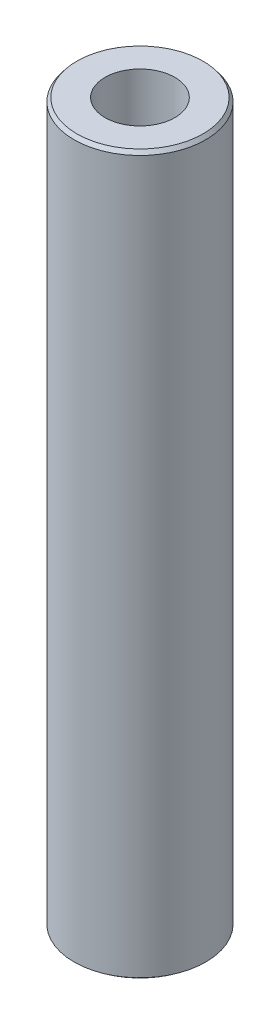
ISO-10303-21;
HEADER;
FILE_DESCRIPTION(('STEP AP214'),'2;1');
FILE_NAME('part.step','',(''),(''),'','','');
FILE_SCHEMA(('AUTOMOTIVE_DESIGN { 1 0 10303 214 1 1 1 1 }'));
ENDSEC;
DATA;
#1=APPLICATION_CONTEXT('core data for automotive mechanical design processes');
#2=APPLICATION_PROTOCOL_DEFINITION('international standard','automotive_design',2000,#1);
#3=PRODUCT_CONTEXT('',#1,'mechanical');
#4=PRODUCT('Part','Part','',(#3));
#5=PRODUCT_RELATED_PRODUCT_CATEGORY('part','',(#4));
#6=PRODUCT_DEFINITION_FORMATION('','',#4);
#7=PRODUCT_DEFINITION_CONTEXT('part definition',#1,'design');
#8=PRODUCT_DEFINITION('design','',#6,#7);
#9=PRODUCT_DEFINITION_SHAPE('','',#8);
#10=(LENGTH_UNIT() NAMED_UNIT(*) SI_UNIT(.MILLI.,.METRE.));
#11=(NAMED_UNIT(*) PLANE_ANGLE_UNIT() SI_UNIT($,.RADIAN.));
#12=(NAMED_UNIT(*) SI_UNIT($,.STERADIAN.) SOLID_ANGLE_UNIT());
#13=UNCERTAINTY_MEASURE_WITH_UNIT(LENGTH_MEASURE(1.E-05),#10,'distance_accuracy_value','');
#14=(GEOMETRIC_REPRESENTATION_CONTEXT(3) GLOBAL_UNCERTAINTY_ASSIGNED_CONTEXT((#13)) GLOBAL_UNIT_ASSIGNED_CONTEXT((#10,
#11,#12)) REPRESENTATION_CONTEXT('',''));
#15=CARTESIAN_POINT('',(0.,0.,0.));
#16=DIRECTION('',(0.,0.,1.));
#17=DIRECTION('',(1.,0.,0.));
#18=AXIS2_PLACEMENT_3D('',#15,#16,#17);
#19=CARTESIAN_POINT('',(0.,600.,0.));
#20=DIRECTION('',(0.,-1.,0.));
#21=DIRECTION('',(0.,0.,-1.));
#22=AXIS2_PLACEMENT_3D('',#19,#20,#21);
#23=CYLINDRICAL_SURFACE('',#22,55.);
#24=CARTESIAN_POINT('',(0.,596.930224957975,0.));
#25=DIRECTION('',(0.,1.,0.));
#26=DIRECTION('',(0.,0.,1.));
#27=AXIS2_PLACEMENT_3D('',#24,#25,#26);
#28=CIRCLE('',#27,55.);
#29=CARTESIAN_POINT('',(0.,596.930224957975,55.));
#30=VERTEX_POINT('',#29);
#31=EDGE_CURVE('E50',#30,#30,#28,.F.);
#32=ORIENTED_EDGE('',*,*,#31,.T.);
#33=EDGE_LOOP('',(#32));
#34=FACE_BOUND('',#33,.T.);
#35=CARTESIAN_POINT('',(0.,2.34177844244343,0.));
#36=DIRECTION('',(0.,1.,0.));
#37=DIRECTION('',(0.,0.,1.));
#38=AXIS2_PLACEMENT_3D('',#35,#36,#37);
#39=CIRCLE('',#38,55.);
#40=CARTESIAN_POINT('',(0.,2.34177844244343,55.));
#41=VERTEX_POINT('',#40);
#42=EDGE_CURVE('E51',#41,#41,#39,.T.);
#43=ORIENTED_EDGE('',*,*,#42,.T.);
#44=EDGE_LOOP('',(#43));
#45=FACE_BOUND('',#44,.T.);
#46=ADVANCED_FACE('F39',(#34,#45),#23,.T.);
#47=CARTESIAN_POINT('',(0.,600.,0.));
#48=DIRECTION('',(0.,1.,0.));
#49=DIRECTION('',(0.,0.,1.));
#50=AXIS2_PLACEMENT_3D('',#47,#48,#49);
#51=PLANE('',#50);
#52=CARTESIAN_POINT('',(0.,600.,0.));
#53=DIRECTION('',(0.,1.,0.));
#54=DIRECTION('',(0.,0.,1.));
#55=AXIS2_PLACEMENT_3D('',#52,#53,#54);
#56=CIRCLE('',#55,52.6582215575566);
#57=CARTESIAN_POINT('',(0.,600.,52.6582215575566));
#58=VERTEX_POINT('',#57);
#59=EDGE_CURVE('E54',#58,#58,#56,.T.);
#60=ORIENTED_EDGE('',*,*,#59,.T.);
#61=EDGE_LOOP('',(#60));
#62=FACE_BOUND('',#61,.T.);
#63=CARTESIAN_POINT('',(0.,600.,0.));
#64=DIRECTION('',(0.,1.,0.));
#65=DIRECTION('',(0.,0.,1.));
#66=AXIS2_PLACEMENT_3D('',#63,#64,#65);
#67=CIRCLE('',#66,29.1649711674055);
#68=CARTESIAN_POINT('',(0.,600.,29.1649711674055));
#69=VERTEX_POINT('',#68);
#70=EDGE_CURVE('E58',#69,#69,#67,.T.);
#71=ORIENTED_EDGE('',*,*,#70,.F.);
#72=EDGE_LOOP('',(#71));
#73=FACE_BOUND('',#72,.T.);
#74=ADVANCED_FACE('F69',(#62,#73),#51,.T.);
#75=CARTESIAN_POINT('',(0.,0.,0.));
#76=DIRECTION('',(0.,1.,0.));
#77=DIRECTION('',(0.,0.,1.));
#78=AXIS2_PLACEMENT_3D('',#75,#76,#77);
#79=PLANE('',#78);
#80=CARTESIAN_POINT('',(0.,0.,0.));
#81=DIRECTION('',(0.,1.,0.));
#82=DIRECTION('',(0.,0.,1.));
#83=AXIS2_PLACEMENT_3D('',#80,#81,#82);
#84=CIRCLE('',#83,51.9302249579754);
#85=CARTESIAN_POINT('',(0.,0.,51.9302249579754));
#86=VERTEX_POINT('',#85);
#87=EDGE_CURVE('E10',#86,#86,#84,.F.);
#88=ORIENTED_EDGE('',*,*,#87,.T.);
#89=EDGE_LOOP('',(#88));
#90=FACE_BOUND('',#89,.T.);
#91=CARTESIAN_POINT('',(0.,0.,0.));
#92=DIRECTION('',(0.,1.,0.));
#93=DIRECTION('',(0.,0.,1.));
#94=AXIS2_PLACEMENT_3D('',#91,#92,#93);
#95=CIRCLE('',#94,29.1649711674055);
#96=CARTESIAN_POINT('',(0.,0.,29.1649711674055));
#97=VERTEX_POINT('',#96);
#98=EDGE_CURVE('E63',#97,#97,#95,.T.);
#99=ORIENTED_EDGE('',*,*,#98,.T.);
#100=EDGE_LOOP('',(#99));
#101=FACE_BOUND('',#100,.T.);
#102=ADVANCED_FACE('F75',(#90,#101),#79,.F.);
#103=CARTESIAN_POINT('',(0.,600.,0.));
#104=DIRECTION('',(0.,-1.,0.));
#105=DIRECTION('',(0.,0.,-1.));
#106=AXIS2_PLACEMENT_3D('',#103,#104,#105);
#107=CYLINDRICAL_SURFACE('',#106,29.1649711674055);
#108=ORIENTED_EDGE('',*,*,#70,.T.);
#109=EDGE_LOOP('',(#108));
#110=FACE_BOUND('',#109,.T.);
#111=ORIENTED_EDGE('',*,*,#98,.F.);
#112=EDGE_LOOP('',(#111));
#113=FACE_BOUND('',#112,.T.);
#114=ADVANCED_FACE('F70',(#110,#113),#107,.F.);
#115=CARTESIAN_POINT('',(0.,600.,0.));
#116=DIRECTION('',(0.,-1.,0.));
#117=DIRECTION('',(0.,0.,-1.));
#118=AXIS2_PLACEMENT_3D('',#115,#116,#117);
#119=CONICAL_SURFACE('',#118,52.6582215575566,0.651674625701286);
#120=ORIENTED_EDGE('',*,*,#31,.F.);
#121=EDGE_LOOP('',(#120));
#122=FACE_BOUND('',#121,.T.);
#123=ORIENTED_EDGE('',*,*,#59,.F.);
#124=EDGE_LOOP('',(#123));
#125=FACE_BOUND('',#124,.T.);
#126=ADVANCED_FACE('F81',(#122,#125),#119,.T.);
#127=CARTESIAN_POINT('',(0.,2.34177844244343,0.));
#128=DIRECTION('',(0.,1.,0.));
#129=DIRECTION('',(0.,0.,1.));
#130=AXIS2_PLACEMENT_3D('',#127,#128,#129);
#131=CONICAL_SURFACE('',#130,55.,0.919121701093595);
#132=ORIENTED_EDGE('',*,*,#87,.F.);
#133=EDGE_LOOP('',(#132));
#134=FACE_BOUND('',#133,.T.);
#135=ORIENTED_EDGE('',*,*,#42,.F.);
#136=EDGE_LOOP('',(#135));
#137=FACE_BOUND('',#136,.T.);
#138=ADVANCED_FACE('F45',(#134,#137),#131,.T.);
#139=CLOSED_SHELL('',(#46,#74,#102,#114,#126,#138));
#140=MANIFOLD_SOLID_BREP('B2',#139);
#141=ADVANCED_BREP_SHAPE_REPRESENTATION('',(#18,#140),#14);
#142=SHAPE_DEFINITION_REPRESENTATION(#9,#141);
ENDSEC;
END-ISO-10303-21;
